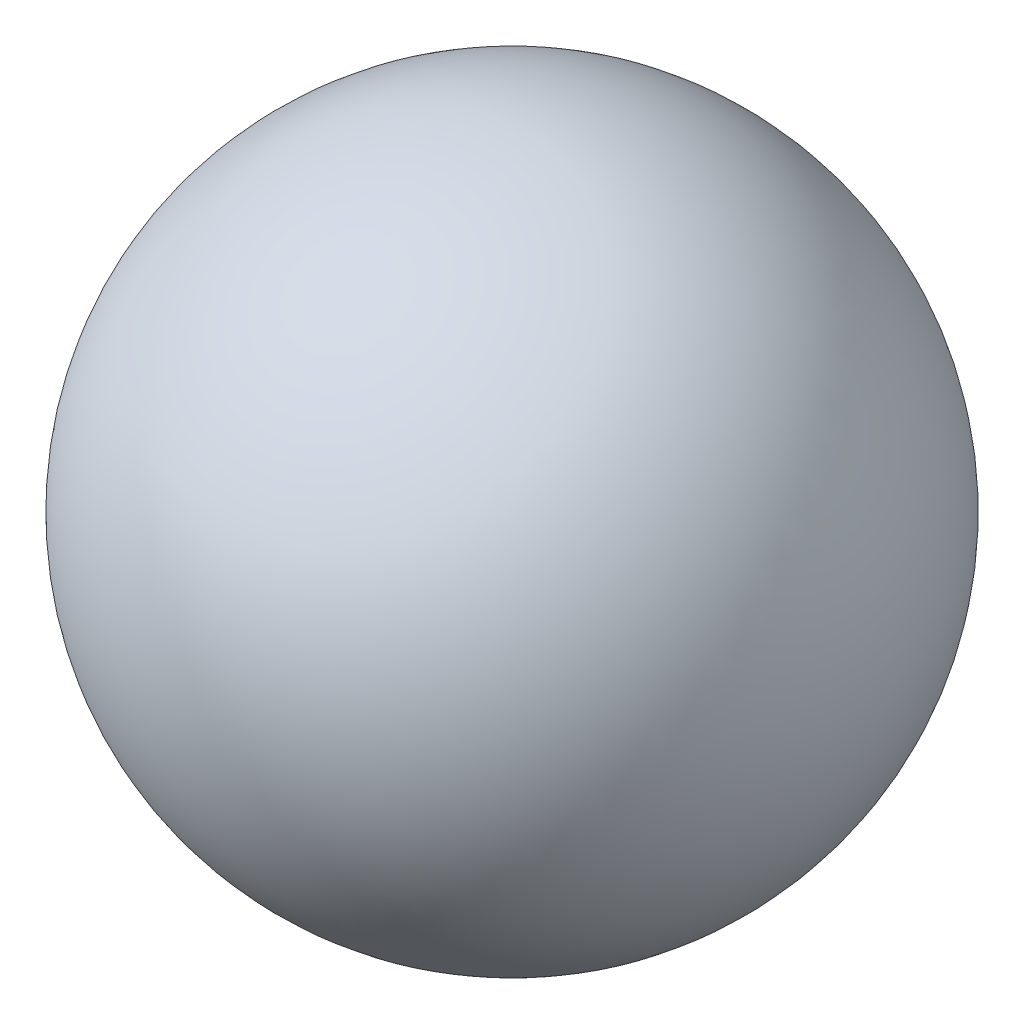
ISO-10303-21;
HEADER;
FILE_DESCRIPTION(('STEP AP214'),'2;1');
FILE_NAME('part.step','',(''),(''),'','','');
FILE_SCHEMA(('AUTOMOTIVE_DESIGN { 1 0 10303 214 1 1 1 1 }'));
ENDSEC;
DATA;
#1=APPLICATION_CONTEXT('core data for automotive mechanical design processes');
#2=APPLICATION_PROTOCOL_DEFINITION('international standard','automotive_design',2000,#1);
#3=PRODUCT_CONTEXT('',#1,'mechanical');
#4=PRODUCT('Part','Part','',(#3));
#5=PRODUCT_RELATED_PRODUCT_CATEGORY('part','',(#4));
#6=PRODUCT_DEFINITION_FORMATION('','',#4);
#7=PRODUCT_DEFINITION_CONTEXT('part definition',#1,'design');
#8=PRODUCT_DEFINITION('design','',#6,#7);
#9=PRODUCT_DEFINITION_SHAPE('','',#8);
#10=(LENGTH_UNIT() NAMED_UNIT(*) SI_UNIT(.MILLI.,.METRE.));
#11=(NAMED_UNIT(*) PLANE_ANGLE_UNIT() SI_UNIT($,.RADIAN.));
#12=(NAMED_UNIT(*) SI_UNIT($,.STERADIAN.) SOLID_ANGLE_UNIT());
#13=UNCERTAINTY_MEASURE_WITH_UNIT(LENGTH_MEASURE(1.E-05),#10,'distance_accuracy_value','');
#14=(GEOMETRIC_REPRESENTATION_CONTEXT(3) GLOBAL_UNCERTAINTY_ASSIGNED_CONTEXT((#13)) GLOBAL_UNIT_ASSIGNED_CONTEXT((#10,
#11,#12)) REPRESENTATION_CONTEXT('',''));
#15=CARTESIAN_POINT('',(0.,0.,0.));
#16=DIRECTION('',(0.,0.,1.));
#17=DIRECTION('',(1.,0.,0.));
#18=AXIS2_PLACEMENT_3D('',#15,#16,#17);
#19=CARTESIAN_POINT('',(2.5,8.25,0.));
#20=DIRECTION('',(0.,-1.,0.));
#21=DIRECTION('',(0.,0.,-1.));
#22=AXIS2_PLACEMENT_3D('',#19,#20,#21);
#23=SPHERICAL_SURFACE('',#22,1.1905);
#24=CARTESIAN_POINT('',(2.5,9.4405,0.));
#25=VERTEX_POINT('',#24);
#26=VERTEX_LOOP('',#25);
#27=FACE_BOUND('',#26,.T.);
#28=CARTESIAN_POINT('',(2.5,7.0595,0.));
#29=VERTEX_POINT('',#28);
#30=VERTEX_LOOP('',#29);
#31=FACE_BOUND('',#30,.T.);
#32=ADVANCED_FACE('F15',(#27,#31),#23,.T.);
#33=CLOSED_SHELL('',(#32));
#34=MANIFOLD_SOLID_BREP('B1',#33);
#35=ADVANCED_BREP_SHAPE_REPRESENTATION('',(#18,#34),#14);
#36=SHAPE_DEFINITION_REPRESENTATION(#9,#35);
ENDSEC;
END-ISO-10303-21;
